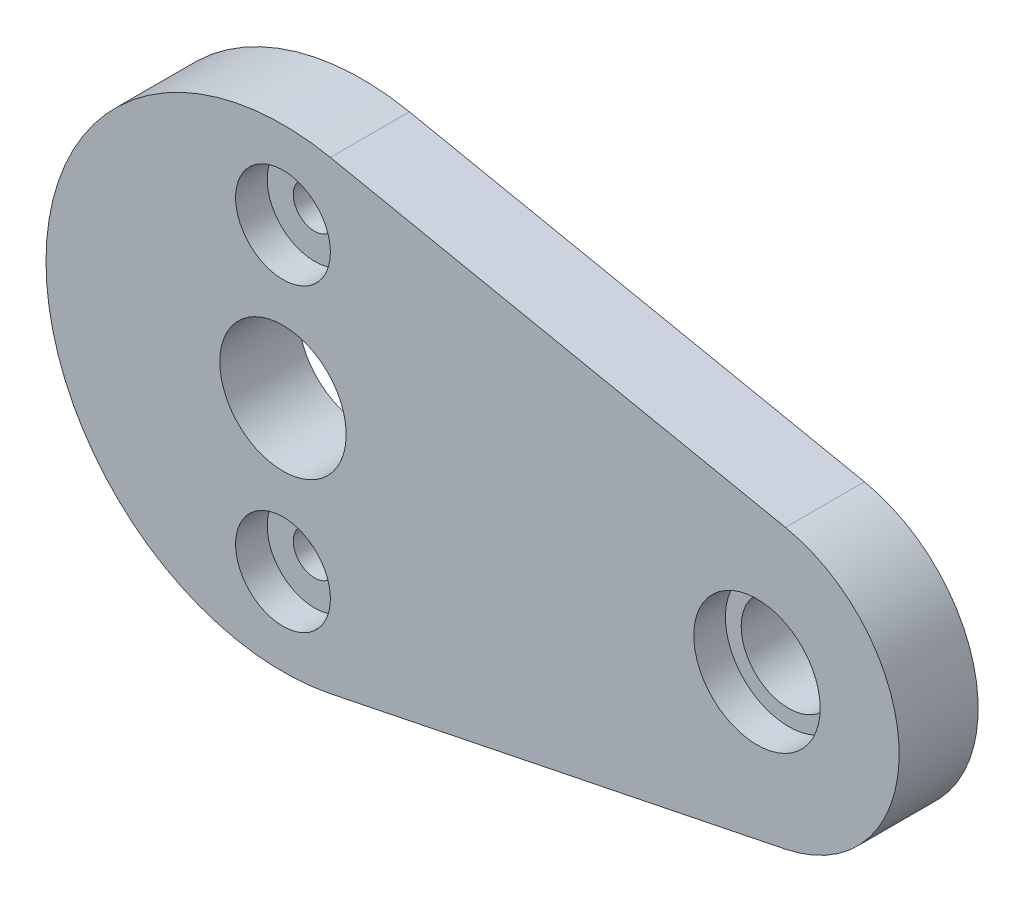
ISO-10303-21;
HEADER;
FILE_DESCRIPTION(('STEP AP214'),'2;1');
FILE_NAME('part.step','',(''),(''),'','','');
FILE_SCHEMA(('AUTOMOTIVE_DESIGN { 1 0 10303 214 1 1 1 1 }'));
ENDSEC;
DATA;
#1=APPLICATION_CONTEXT('core data for automotive mechanical design processes');
#2=APPLICATION_PROTOCOL_DEFINITION('international standard','automotive_design',2000,#1);
#3=PRODUCT_CONTEXT('',#1,'mechanical');
#4=PRODUCT('Part','Part','',(#3));
#5=PRODUCT_RELATED_PRODUCT_CATEGORY('part','',(#4));
#6=PRODUCT_DEFINITION_FORMATION('','',#4);
#7=PRODUCT_DEFINITION_CONTEXT('part definition',#1,'design');
#8=PRODUCT_DEFINITION('design','',#6,#7);
#9=PRODUCT_DEFINITION_SHAPE('','',#8);
#10=(LENGTH_UNIT() NAMED_UNIT(*) SI_UNIT(.MILLI.,.METRE.));
#11=(NAMED_UNIT(*) PLANE_ANGLE_UNIT() SI_UNIT($,.RADIAN.));
#12=(NAMED_UNIT(*) SI_UNIT($,.STERADIAN.) SOLID_ANGLE_UNIT());
#13=UNCERTAINTY_MEASURE_WITH_UNIT(LENGTH_MEASURE(1.E-05),#10,'distance_accuracy_value','');
#14=(GEOMETRIC_REPRESENTATION_CONTEXT(3) GLOBAL_UNCERTAINTY_ASSIGNED_CONTEXT((#13)) GLOBAL_UNIT_ASSIGNED_CONTEXT((#10,
#11,#12)) REPRESENTATION_CONTEXT('',''));
#15=CARTESIAN_POINT('',(0.,0.,0.));
#16=DIRECTION('',(0.,0.,1.));
#17=DIRECTION('',(1.,0.,0.));
#18=AXIS2_PLACEMENT_3D('',#15,#16,#17);
#19=CARTESIAN_POINT('',(0.,-9.5,3.));
#20=DIRECTION('',(0.,0.,1.));
#21=DIRECTION('',(1.,0.,0.));
#22=AXIS2_PLACEMENT_3D('',#19,#20,#21);
#23=CYLINDRICAL_SURFACE('',#22,3.);
#24=CARTESIAN_POINT('',(0.,-9.5,5.));
#25=DIRECTION('',(0.,0.,1.));
#26=DIRECTION('',(1.,0.,0.));
#27=AXIS2_PLACEMENT_3D('',#24,#25,#26);
#28=CIRCLE('',#27,3.);
#29=CARTESIAN_POINT('',(2.99999999999993,-9.5,5.));
#30=VERTEX_POINT('',#29);
#31=EDGE_CURVE('E122',#30,#30,#28,.F.);
#32=ORIENTED_EDGE('',*,*,#31,.F.);
#33=EDGE_LOOP('',(#32));
#34=FACE_BOUND('',#33,.T.);
#35=CARTESIAN_POINT('',(0.,-9.5,3.));
#36=DIRECTION('',(0.,0.,1.));
#37=DIRECTION('',(1.,0.,0.));
#38=AXIS2_PLACEMENT_3D('',#35,#36,#37);
#39=CIRCLE('',#38,3.);
#40=CARTESIAN_POINT('',(2.99999999999993,-9.5,3.));
#41=VERTEX_POINT('',#40);
#42=EDGE_CURVE('E20',#41,#41,#39,.T.);
#43=ORIENTED_EDGE('',*,*,#42,.F.);
#44=EDGE_LOOP('',(#43));
#45=FACE_BOUND('',#44,.T.);
#46=ADVANCED_FACE('F17',(#34,#45),#23,.F.);
#47=CARTESIAN_POINT('',(0.,9.5,3.));
#48=DIRECTION('',(0.,0.,1.));
#49=DIRECTION('',(1.,0.,0.));
#50=AXIS2_PLACEMENT_3D('',#47,#48,#49);
#51=CYLINDRICAL_SURFACE('',#50,3.);
#52=CARTESIAN_POINT('',(0.,9.5,5.));
#53=DIRECTION('',(0.,0.,1.));
#54=DIRECTION('',(1.,0.,0.));
#55=AXIS2_PLACEMENT_3D('',#52,#53,#54);
#56=CIRCLE('',#55,3.);
#57=CARTESIAN_POINT('',(3.,9.5,5.));
#58=VERTEX_POINT('',#57);
#59=EDGE_CURVE('E119',#58,#58,#56,.F.);
#60=ORIENTED_EDGE('',*,*,#59,.F.);
#61=EDGE_LOOP('',(#60));
#62=FACE_BOUND('',#61,.T.);
#63=CARTESIAN_POINT('',(0.,9.5,3.));
#64=DIRECTION('',(0.,0.,1.));
#65=DIRECTION('',(1.,0.,0.));
#66=AXIS2_PLACEMENT_3D('',#63,#64,#65);
#67=CIRCLE('',#66,3.);
#68=CARTESIAN_POINT('',(3.,9.5,3.));
#69=VERTEX_POINT('',#68);
#70=EDGE_CURVE('E124',#69,#69,#67,.T.);
#71=ORIENTED_EDGE('',*,*,#70,.F.);
#72=EDGE_LOOP('',(#71));
#73=FACE_BOUND('',#72,.T.);
#74=ADVANCED_FACE('F134',(#62,#73),#51,.F.);
#75=CARTESIAN_POINT('',(30.,0.,3.));
#76=DIRECTION('',(0.,0.,1.));
#77=DIRECTION('',(1.,0.,0.));
#78=AXIS2_PLACEMENT_3D('',#75,#76,#77);
#79=CYLINDRICAL_SURFACE('',#78,4.);
#80=CARTESIAN_POINT('',(30.,0.,5.));
#81=DIRECTION('',(0.,0.,1.));
#82=DIRECTION('',(1.,0.,0.));
#83=AXIS2_PLACEMENT_3D('',#80,#81,#82);
#84=CIRCLE('',#83,4.);
#85=CARTESIAN_POINT('',(34.,0.,5.));
#86=VERTEX_POINT('',#85);
#87=EDGE_CURVE('E116',#86,#86,#84,.F.);
#88=ORIENTED_EDGE('',*,*,#87,.F.);
#89=EDGE_LOOP('',(#88));
#90=FACE_BOUND('',#89,.T.);
#91=CARTESIAN_POINT('',(30.,0.,3.));
#92=DIRECTION('',(0.,0.,1.));
#93=DIRECTION('',(1.,0.,0.));
#94=AXIS2_PLACEMENT_3D('',#91,#92,#93);
#95=CIRCLE('',#94,4.);
#96=CARTESIAN_POINT('',(34.,0.,3.));
#97=VERTEX_POINT('',#96);
#98=EDGE_CURVE('E113',#97,#97,#95,.T.);
#99=ORIENTED_EDGE('',*,*,#98,.F.);
#100=EDGE_LOOP('',(#99));
#101=FACE_BOUND('',#100,.T.);
#102=ADVANCED_FACE('F140',(#90,#101),#79,.F.);
#103=CARTESIAN_POINT('',(0.,-9.5,3.));
#104=DIRECTION('',(0.,0.,1.));
#105=DIRECTION('',(1.,0.,0.));
#106=AXIS2_PLACEMENT_3D('',#103,#104,#105);
#107=PLANE('',#106);
#108=CARTESIAN_POINT('',(0.,-9.5,3.));
#109=DIRECTION('',(0.,0.,1.));
#110=DIRECTION('',(1.,0.,0.));
#111=AXIS2_PLACEMENT_3D('',#108,#109,#110);
#112=CIRCLE('',#111,1.35);
#113=CARTESIAN_POINT('',(1.34999999999993,-9.5,3.));
#114=VERTEX_POINT('',#113);
#115=EDGE_CURVE('E110',#114,#114,#112,.F.);
#116=ORIENTED_EDGE('',*,*,#115,.T.);
#117=EDGE_LOOP('',(#116));
#118=FACE_BOUND('',#117,.T.);
#119=ORIENTED_EDGE('',*,*,#42,.T.);
#120=EDGE_LOOP('',(#119));
#121=FACE_BOUND('',#120,.T.);
#122=ADVANCED_FACE('F131',(#118,#121),#107,.T.);
#123=CARTESIAN_POINT('',(0.,9.5,3.));
#124=DIRECTION('',(0.,0.,1.));
#125=DIRECTION('',(1.,0.,0.));
#126=AXIS2_PLACEMENT_3D('',#123,#124,#125);
#127=PLANE('',#126);
#128=CARTESIAN_POINT('',(0.,9.5,3.));
#129=DIRECTION('',(0.,0.,1.));
#130=DIRECTION('',(1.,0.,0.));
#131=AXIS2_PLACEMENT_3D('',#128,#129,#130);
#132=CIRCLE('',#131,1.35);
#133=CARTESIAN_POINT('',(1.35,9.5,3.));
#134=VERTEX_POINT('',#133);
#135=EDGE_CURVE('E83',#134,#134,#132,.F.);
#136=ORIENTED_EDGE('',*,*,#135,.T.);
#137=EDGE_LOOP('',(#136));
#138=FACE_BOUND('',#137,.T.);
#139=ORIENTED_EDGE('',*,*,#70,.T.);
#140=EDGE_LOOP('',(#139));
#141=FACE_BOUND('',#140,.T.);
#142=ADVANCED_FACE('F184',(#138,#141),#127,.T.);
#143=CARTESIAN_POINT('',(0.,0.,5.));
#144=DIRECTION('',(0.,0.,1.));
#145=DIRECTION('',(1.,0.,0.));
#146=AXIS2_PLACEMENT_3D('',#143,#144,#145);
#147=PLANE('',#146);
#148=CARTESIAN_POINT('',(30.,0.,5.));
#149=DIRECTION('',(0.,0.,-1.));
#150=DIRECTION('',(-1.,0.,0.));
#151=AXIS2_PLACEMENT_3D('',#148,#149,#150);
#152=CIRCLE('',#151,8.99999999999999);
#153=CARTESIAN_POINT('',(31.8,8.81816307401943,5.));
#154=VERTEX_POINT('',#153);
#155=CARTESIAN_POINT('',(31.8,-8.81816307401944,5.));
#156=VERTEX_POINT('',#155);
#157=EDGE_CURVE('E55',#154,#156,#152,.T.);
#158=ORIENTED_EDGE('',*,*,#157,.F.);
#159=DIRECTION('',(0.979795897113271,-0.2,0.));
#160=VECTOR('',#159,1.);
#161=CARTESIAN_POINT('',(3.,14.6969384566991,5.));
#162=LINE('',#161,#160);
#163=CARTESIAN_POINT('',(3.,14.6969384566991,5.));
#164=VERTEX_POINT('',#163);
#165=EDGE_CURVE('E67',#154,#164,#162,.F.);
#166=ORIENTED_EDGE('',*,*,#165,.T.);
#167=CARTESIAN_POINT('',(0.,0.,5.));
#168=DIRECTION('',(0.,0.,-1.));
#169=DIRECTION('',(-1.,0.,0.));
#170=AXIS2_PLACEMENT_3D('',#167,#168,#169);
#171=CIRCLE('',#170,15.);
#172=CARTESIAN_POINT('',(3.,-14.6969384566991,5.));
#173=VERTEX_POINT('',#172);
#174=EDGE_CURVE('E60',#173,#164,#171,.T.);
#175=ORIENTED_EDGE('',*,*,#174,.F.);
#176=DIRECTION('',(-0.979795897113271,-0.2,0.));
#177=VECTOR('',#176,1.);
#178=CARTESIAN_POINT('',(3.,-14.6969384566991,5.));
#179=LINE('',#178,#177);
#180=EDGE_CURVE('E64',#173,#156,#179,.F.);
#181=ORIENTED_EDGE('',*,*,#180,.T.);
#182=EDGE_LOOP('',(#158,#166,#175,#181));
#183=FACE_BOUND('',#182,.T.);
#184=CARTESIAN_POINT('',(0.,0.,5.));
#185=DIRECTION('',(0.,0.,-1.));
#186=DIRECTION('',(-1.,0.,0.));
#187=AXIS2_PLACEMENT_3D('',#184,#185,#186);
#188=CIRCLE('',#187,4.);
#189=CARTESIAN_POINT('',(-4.,0.,5.));
#190=VERTEX_POINT('',#189);
#191=EDGE_CURVE('E80',#190,#190,#188,.T.);
#192=ORIENTED_EDGE('',*,*,#191,.T.);
#193=EDGE_LOOP('',(#192));
#194=FACE_BOUND('',#193,.T.);
#195=ORIENTED_EDGE('',*,*,#87,.T.);
#196=EDGE_LOOP('',(#195));
#197=FACE_BOUND('',#196,.T.);
#198=ORIENTED_EDGE('',*,*,#59,.T.);
#199=EDGE_LOOP('',(#198));
#200=FACE_BOUND('',#199,.T.);
#201=ORIENTED_EDGE('',*,*,#31,.T.);
#202=EDGE_LOOP('',(#201));
#203=FACE_BOUND('',#202,.T.);
#204=ADVANCED_FACE('F62',(#183,#194,#197,#200,#203),#147,.T.);
#205=CARTESIAN_POINT('',(30.,0.,3.));
#206=DIRECTION('',(0.,0.,1.));
#207=DIRECTION('',(1.,0.,0.));
#208=AXIS2_PLACEMENT_3D('',#205,#206,#207);
#209=PLANE('',#208);
#210=ORIENTED_EDGE('',*,*,#98,.T.);
#211=EDGE_LOOP('',(#210));
#212=FACE_BOUND('',#211,.T.);
#213=CARTESIAN_POINT('',(30.,0.,3.));
#214=DIRECTION('',(0.,0.,-1.));
#215=DIRECTION('',(-1.,0.,0.));
#216=AXIS2_PLACEMENT_3D('',#213,#214,#215);
#217=CIRCLE('',#216,3.);
#218=CARTESIAN_POINT('',(27.,0.,3.));
#219=VERTEX_POINT('',#218);
#220=EDGE_CURVE('E104',#219,#219,#217,.T.);
#221=ORIENTED_EDGE('',*,*,#220,.T.);
#222=EDGE_LOOP('',(#221));
#223=FACE_BOUND('',#222,.T.);
#224=ADVANCED_FACE('F177',(#212,#223),#209,.T.);
#225=CARTESIAN_POINT('',(0.,-9.5,0.));
#226=DIRECTION('',(0.,0.,1.));
#227=DIRECTION('',(1.,0.,0.));
#228=AXIS2_PLACEMENT_3D('',#225,#226,#227);
#229=CYLINDRICAL_SURFACE('',#228,1.35);
#230=CARTESIAN_POINT('',(0.,-9.5,0.));
#231=DIRECTION('',(0.,0.,1.));
#232=DIRECTION('',(1.,0.,0.));
#233=AXIS2_PLACEMENT_3D('',#230,#231,#232);
#234=CIRCLE('',#233,1.35);
#235=CARTESIAN_POINT('',(1.34999999999993,-9.5,0.));
#236=VERTEX_POINT('',#235);
#237=EDGE_CURVE('E101',#236,#236,#234,.F.);
#238=ORIENTED_EDGE('',*,*,#237,.T.);
#239=EDGE_LOOP('',(#238));
#240=FACE_BOUND('',#239,.T.);
#241=ORIENTED_EDGE('',*,*,#115,.F.);
#242=EDGE_LOOP('',(#241));
#243=FACE_BOUND('',#242,.T.);
#244=ADVANCED_FACE('F173',(#240,#243),#229,.F.);
#245=CARTESIAN_POINT('',(0.,9.5,0.));
#246=DIRECTION('',(0.,0.,1.));
#247=DIRECTION('',(1.,0.,0.));
#248=AXIS2_PLACEMENT_3D('',#245,#246,#247);
#249=CYLINDRICAL_SURFACE('',#248,1.35);
#250=CARTESIAN_POINT('',(0.,9.5,0.));
#251=DIRECTION('',(0.,0.,1.));
#252=DIRECTION('',(1.,0.,0.));
#253=AXIS2_PLACEMENT_3D('',#250,#251,#252);
#254=CIRCLE('',#253,1.35);
#255=CARTESIAN_POINT('',(1.35,9.5,0.));
#256=VERTEX_POINT('',#255);
#257=EDGE_CURVE('E98',#256,#256,#254,.F.);
#258=ORIENTED_EDGE('',*,*,#257,.T.);
#259=EDGE_LOOP('',(#258));
#260=FACE_BOUND('',#259,.T.);
#261=ORIENTED_EDGE('',*,*,#135,.F.);
#262=EDGE_LOOP('',(#261));
#263=FACE_BOUND('',#262,.T.);
#264=ADVANCED_FACE('F169',(#260,#263),#249,.F.);
#265=CARTESIAN_POINT('',(0.,0.,5.));
#266=DIRECTION('',(0.,0.,-1.));
#267=DIRECTION('',(-1.,0.,0.));
#268=AXIS2_PLACEMENT_3D('',#265,#266,#267);
#269=CYLINDRICAL_SURFACE('',#268,4.);
#270=CARTESIAN_POINT('',(0.,0.,0.));
#271=DIRECTION('',(0.,0.,-1.));
#272=DIRECTION('',(-1.,0.,0.));
#273=AXIS2_PLACEMENT_3D('',#270,#271,#272);
#274=CIRCLE('',#273,4.);
#275=CARTESIAN_POINT('',(-4.,0.,0.));
#276=VERTEX_POINT('',#275);
#277=EDGE_CURVE('E95',#276,#276,#274,.T.);
#278=ORIENTED_EDGE('',*,*,#277,.T.);
#279=EDGE_LOOP('',(#278));
#280=FACE_BOUND('',#279,.T.);
#281=ORIENTED_EDGE('',*,*,#191,.F.);
#282=EDGE_LOOP('',(#281));
#283=FACE_BOUND('',#282,.T.);
#284=ADVANCED_FACE('F166',(#280,#283),#269,.F.);
#285=CARTESIAN_POINT('',(3.,-14.6969384566991,5.));
#286=DIRECTION('',(-0.2,0.979795897113271,0.));
#287=DIRECTION('',(-0.979795897113271,-0.2,0.));
#288=AXIS2_PLACEMENT_3D('',#285,#286,#287);
#289=PLANE('',#288);
#290=DIRECTION('',(0.,0.,-1.));
#291=VECTOR('',#290,1.);
#292=CARTESIAN_POINT('',(31.8,-8.81816307401943,5.));
#293=LINE('',#292,#291);
#294=CARTESIAN_POINT('',(31.8,-8.81816307401943,0.));
#295=VERTEX_POINT('',#294);
#296=EDGE_CURVE('E77',#156,#295,#293,.T.);
#297=ORIENTED_EDGE('',*,*,#296,.F.);
#298=ORIENTED_EDGE('',*,*,#180,.F.);
#299=DIRECTION('',(0.,0.,1.));
#300=VECTOR('',#299,1.);
#301=CARTESIAN_POINT('',(3.,-14.6969384566991,5.));
#302=LINE('',#301,#300);
#303=CARTESIAN_POINT('',(3.,-14.6969384566991,0.));
#304=VERTEX_POINT('',#303);
#305=EDGE_CURVE('E76',#304,#173,#302,.T.);
#306=ORIENTED_EDGE('',*,*,#305,.F.);
#307=DIRECTION('',(0.979795897113271,0.2,0.));
#308=VECTOR('',#307,1.);
#309=CARTESIAN_POINT('',(3.,-14.6969384566991,0.));
#310=LINE('',#309,#308);
#311=EDGE_CURVE('E93',#304,#295,#310,.T.);
#312=ORIENTED_EDGE('',*,*,#311,.T.);
#313=EDGE_LOOP('',(#297,#298,#306,#312));
#314=FACE_BOUND('',#313,.T.);
#315=ADVANCED_FACE('F74',(#314),#289,.F.);
#316=CARTESIAN_POINT('',(30.,0.,5.));
#317=DIRECTION('',(0.,0.,-1.));
#318=DIRECTION('',(-1.,0.,0.));
#319=AXIS2_PLACEMENT_3D('',#316,#317,#318);
#320=CYLINDRICAL_SURFACE('',#319,8.99999999999999);
#321=ORIENTED_EDGE('',*,*,#157,.T.);
#322=ORIENTED_EDGE('',*,*,#296,.T.);
#323=CARTESIAN_POINT('',(30.,0.,0.));
#324=DIRECTION('',(0.,0.,-1.));
#325=DIRECTION('',(-1.,0.,0.));
#326=AXIS2_PLACEMENT_3D('',#323,#324,#325);
#327=CIRCLE('',#326,8.99999999999999);
#328=CARTESIAN_POINT('',(31.8,8.81816307401943,0.));
#329=VERTEX_POINT('',#328);
#330=EDGE_CURVE('E90',#295,#329,#327,.F.);
#331=ORIENTED_EDGE('',*,*,#330,.T.);
#332=DIRECTION('',(0.,0.,1.));
#333=VECTOR('',#332,1.);
#334=CARTESIAN_POINT('',(31.8,8.81816307401943,5.));
#335=LINE('',#334,#333);
#336=EDGE_CURVE('E88',#329,#154,#335,.T.);
#337=ORIENTED_EDGE('',*,*,#336,.T.);
#338=EDGE_LOOP('',(#321,#322,#331,#337));
#339=FACE_BOUND('',#338,.T.);
#340=ADVANCED_FACE('F160',(#339),#320,.T.);
#341=CARTESIAN_POINT('',(3.,14.6969384566991,5.));
#342=DIRECTION('',(-0.2,-0.979795897113271,0.));
#343=DIRECTION('',(0.979795897113271,-0.2,0.));
#344=AXIS2_PLACEMENT_3D('',#341,#342,#343);
#345=PLANE('',#344);
#346=DIRECTION('',(0.,0.,-1.));
#347=VECTOR('',#346,1.);
#348=CARTESIAN_POINT('',(3.,14.6969384566991,5.));
#349=LINE('',#348,#347);
#350=CARTESIAN_POINT('',(3.,14.6969384566991,0.));
#351=VERTEX_POINT('',#350);
#352=EDGE_CURVE('E71',#164,#351,#349,.T.);
#353=ORIENTED_EDGE('',*,*,#352,.F.);
#354=ORIENTED_EDGE('',*,*,#165,.F.);
#355=ORIENTED_EDGE('',*,*,#336,.F.);
#356=DIRECTION('',(-0.979795897113271,0.2,0.));
#357=VECTOR('',#356,1.);
#358=CARTESIAN_POINT('',(31.8,8.81816307401943,0.));
#359=LINE('',#358,#357);
#360=EDGE_CURVE('E26',#329,#351,#359,.T.);
#361=ORIENTED_EDGE('',*,*,#360,.T.);
#362=EDGE_LOOP('',(#353,#354,#355,#361));
#363=FACE_BOUND('',#362,.T.);
#364=ADVANCED_FACE('F157',(#363),#345,.F.);
#365=CARTESIAN_POINT('',(0.,0.,5.));
#366=DIRECTION('',(0.,0.,-1.));
#367=DIRECTION('',(-1.,0.,0.));
#368=AXIS2_PLACEMENT_3D('',#365,#366,#367);
#369=CYLINDRICAL_SURFACE('',#368,15.);
#370=ORIENTED_EDGE('',*,*,#352,.T.);
#371=CARTESIAN_POINT('',(0.,0.,0.));
#372=DIRECTION('',(0.,0.,-1.));
#373=DIRECTION('',(-1.,0.,0.));
#374=AXIS2_PLACEMENT_3D('',#371,#372,#373);
#375=CIRCLE('',#374,15.);
#376=EDGE_CURVE('E35',#351,#304,#375,.F.);
#377=ORIENTED_EDGE('',*,*,#376,.T.);
#378=ORIENTED_EDGE('',*,*,#305,.T.);
#379=ORIENTED_EDGE('',*,*,#174,.T.);
#380=EDGE_LOOP('',(#370,#377,#378,#379));
#381=FACE_BOUND('',#380,.T.);
#382=ADVANCED_FACE('F79',(#381),#369,.T.);
#383=CARTESIAN_POINT('',(30.,0.,5.));
#384=DIRECTION('',(0.,0.,-1.));
#385=DIRECTION('',(-1.,0.,0.));
#386=AXIS2_PLACEMENT_3D('',#383,#384,#385);
#387=CYLINDRICAL_SURFACE('',#386,3.);
#388=CARTESIAN_POINT('',(30.,0.,0.));
#389=DIRECTION('',(0.,0.,-1.));
#390=DIRECTION('',(-1.,0.,0.));
#391=AXIS2_PLACEMENT_3D('',#388,#389,#390);
#392=CIRCLE('',#391,3.);
#393=CARTESIAN_POINT('',(27.,0.,0.));
#394=VERTEX_POINT('',#393);
#395=EDGE_CURVE('E11',#394,#394,#392,.T.);
#396=ORIENTED_EDGE('',*,*,#395,.T.);
#397=EDGE_LOOP('',(#396));
#398=FACE_BOUND('',#397,.T.);
#399=ORIENTED_EDGE('',*,*,#220,.F.);
#400=EDGE_LOOP('',(#399));
#401=FACE_BOUND('',#400,.T.);
#402=ADVANCED_FACE('F145',(#398,#401),#387,.F.);
#403=CARTESIAN_POINT('',(0.,0.,0.));
#404=DIRECTION('',(0.,0.,1.));
#405=DIRECTION('',(1.,0.,0.));
#406=AXIS2_PLACEMENT_3D('',#403,#404,#405);
#407=PLANE('',#406);
#408=ORIENTED_EDGE('',*,*,#395,.F.);
#409=EDGE_LOOP('',(#408));
#410=FACE_BOUND('',#409,.T.);
#411=ORIENTED_EDGE('',*,*,#360,.F.);
#412=ORIENTED_EDGE('',*,*,#330,.F.);
#413=ORIENTED_EDGE('',*,*,#311,.F.);
#414=ORIENTED_EDGE('',*,*,#376,.F.);
#415=EDGE_LOOP('',(#411,#412,#413,#414));
#416=FACE_BOUND('',#415,.T.);
#417=ORIENTED_EDGE('',*,*,#277,.F.);
#418=EDGE_LOOP('',(#417));
#419=FACE_BOUND('',#418,.T.);
#420=ORIENTED_EDGE('',*,*,#257,.F.);
#421=EDGE_LOOP('',(#420));
#422=FACE_BOUND('',#421,.T.);
#423=ORIENTED_EDGE('',*,*,#237,.F.);
#424=EDGE_LOOP('',(#423));
#425=FACE_BOUND('',#424,.T.);
#426=ADVANCED_FACE('F143',(#410,#416,#419,#422,#425),#407,.F.);
#427=CLOSED_SHELL('',(#46,#74,#102,#122,#142,#204,#224,#244,#264,#284,#315,#340,#364,#382,#402,#426));
#428=MANIFOLD_SOLID_BREP('B1',#427);
#429=ADVANCED_BREP_SHAPE_REPRESENTATION('',(#18,#428),#14);
#430=SHAPE_DEFINITION_REPRESENTATION(#9,#429);
ENDSEC;
END-ISO-10303-21;
